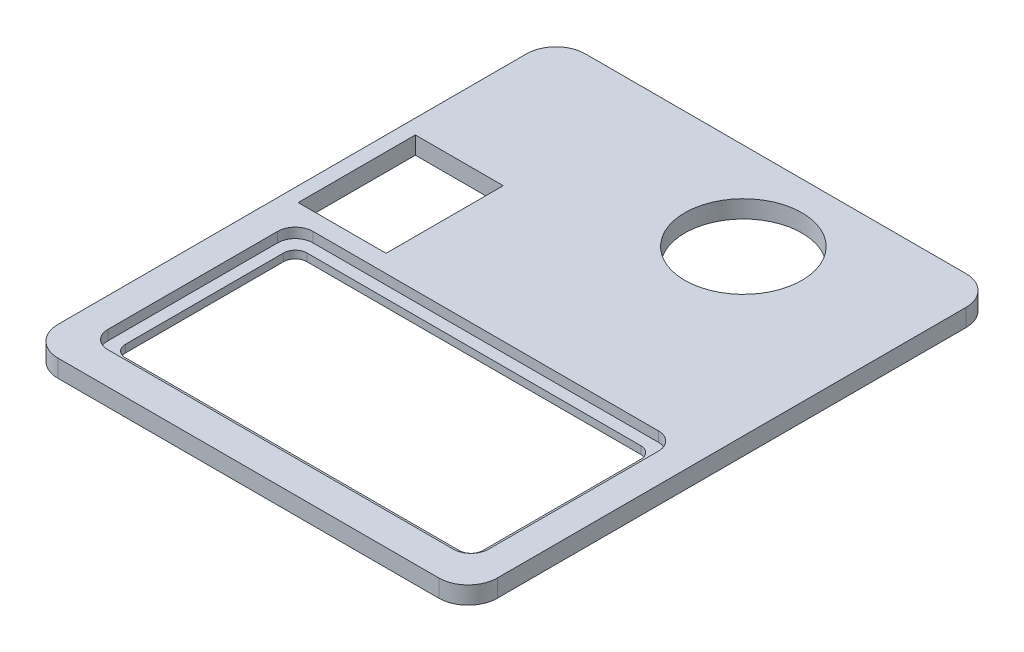
ISO-10303-21;
HEADER;
FILE_DESCRIPTION(('STEP AP214'),'2;1');
FILE_NAME('part.step','',(''),(''),'','','');
FILE_SCHEMA(('AUTOMOTIVE_DESIGN { 1 0 10303 214 1 1 1 1 }'));
ENDSEC;
DATA;
#1=APPLICATION_CONTEXT('core data for automotive mechanical design processes');
#2=APPLICATION_PROTOCOL_DEFINITION('international standard','automotive_design',2000,#1);
#3=PRODUCT_CONTEXT('',#1,'mechanical');
#4=PRODUCT('Part','Part','',(#3));
#5=PRODUCT_RELATED_PRODUCT_CATEGORY('part','',(#4));
#6=PRODUCT_DEFINITION_FORMATION('','',#4);
#7=PRODUCT_DEFINITION_CONTEXT('part definition',#1,'design');
#8=PRODUCT_DEFINITION('design','',#6,#7);
#9=PRODUCT_DEFINITION_SHAPE('','',#8);
#10=(LENGTH_UNIT() NAMED_UNIT(*) SI_UNIT(.MILLI.,.METRE.));
#11=(NAMED_UNIT(*) PLANE_ANGLE_UNIT() SI_UNIT($,.RADIAN.));
#12=(NAMED_UNIT(*) SI_UNIT($,.STERADIAN.) SOLID_ANGLE_UNIT());
#13=UNCERTAINTY_MEASURE_WITH_UNIT(LENGTH_MEASURE(1.E-05),#10,'distance_accuracy_value','');
#14=(GEOMETRIC_REPRESENTATION_CONTEXT(3) GLOBAL_UNCERTAINTY_ASSIGNED_CONTEXT((#13)) GLOBAL_UNIT_ASSIGNED_CONTEXT((#10,
#11,#12)) REPRESENTATION_CONTEXT('',''));
#15=CARTESIAN_POINT('',(0.,0.,0.));
#16=DIRECTION('',(0.,0.,1.));
#17=DIRECTION('',(1.,0.,0.));
#18=AXIS2_PLACEMENT_3D('',#15,#16,#17);
#19=CARTESIAN_POINT('',(70.,3.,-5.));
#20=DIRECTION('',(0.,1.,0.));
#21=DIRECTION('',(0.,0.,1.));
#22=AXIS2_PLACEMENT_3D('',#19,#20,#21);
#23=PLANE('',#22);
#24=CARTESIAN_POINT('',(8.,3.,-8.5));
#25=DIRECTION('',(0.,1.,0.));
#26=DIRECTION('',(0.,0.,1.));
#27=AXIS2_PLACEMENT_3D('',#24,#25,#26);
#28=CIRCLE('',#27,3.);
#29=CARTESIAN_POINT('',(5.,3.,-8.5));
#30=VERTEX_POINT('',#29);
#31=CARTESIAN_POINT('',(8.,3.,-5.5));
#32=VERTEX_POINT('',#31);
#33=EDGE_CURVE('E429',#30,#32,#28,.T.);
#34=ORIENTED_EDGE('',*,*,#33,.F.);
#35=DIRECTION('',(0.,0.,1.));
#36=VECTOR('',#35,1.);
#37=CARTESIAN_POINT('',(5.,3.,-5.));
#38=LINE('',#37,#36);
#39=CARTESIAN_POINT('',(5.,3.,-37.5));
#40=VERTEX_POINT('',#39);
#41=EDGE_CURVE('E405',#40,#30,#38,.T.);
#42=ORIENTED_EDGE('',*,*,#41,.F.);
#43=CARTESIAN_POINT('',(8.,3.,-37.5));
#44=DIRECTION('',(0.,1.,0.));
#45=DIRECTION('',(0.,0.,1.));
#46=AXIS2_PLACEMENT_3D('',#43,#44,#45);
#47=CIRCLE('',#46,3.);
#48=CARTESIAN_POINT('',(8.,3.,-40.5));
#49=VERTEX_POINT('',#48);
#50=EDGE_CURVE('E408',#49,#40,#47,.T.);
#51=ORIENTED_EDGE('',*,*,#50,.F.);
#52=DIRECTION('',(-1.,0.,0.));
#53=VECTOR('',#52,1.);
#54=CARTESIAN_POINT('',(70.,3.,-40.5));
#55=LINE('',#54,#53);
#56=CARTESIAN_POINT('',(67.,3.,-40.5));
#57=VERTEX_POINT('',#56);
#58=EDGE_CURVE('E411',#57,#49,#55,.T.);
#59=ORIENTED_EDGE('',*,*,#58,.F.);
#60=CARTESIAN_POINT('',(67.,3.,-37.5));
#61=DIRECTION('',(0.,1.,0.));
#62=DIRECTION('',(0.,0.,1.));
#63=AXIS2_PLACEMENT_3D('',#60,#61,#62);
#64=CIRCLE('',#63,3.00000000000001);
#65=CARTESIAN_POINT('',(70.,3.,-37.5));
#66=VERTEX_POINT('',#65);
#67=EDGE_CURVE('E414',#66,#57,#64,.T.);
#68=ORIENTED_EDGE('',*,*,#67,.F.);
#69=DIRECTION('',(0.,0.,1.));
#70=VECTOR('',#69,1.);
#71=CARTESIAN_POINT('',(70.,3.,-5.));
#72=LINE('',#71,#70);
#73=CARTESIAN_POINT('',(70.,3.,-8.49999999999999));
#74=VERTEX_POINT('',#73);
#75=EDGE_CURVE('E417',#66,#74,#72,.T.);
#76=ORIENTED_EDGE('',*,*,#75,.T.);
#77=CARTESIAN_POINT('',(67.,3.,-8.49999999999999));
#78=DIRECTION('',(0.,1.,0.));
#79=DIRECTION('',(0.,0.,1.));
#80=AXIS2_PLACEMENT_3D('',#77,#78,#79);
#81=CIRCLE('',#80,3.);
#82=CARTESIAN_POINT('',(67.,3.,-5.49999999999999));
#83=VERTEX_POINT('',#82);
#84=EDGE_CURVE('E421',#74,#83,#81,.F.);
#85=ORIENTED_EDGE('',*,*,#84,.T.);
#86=DIRECTION('',(-1.,0.,0.));
#87=VECTOR('',#86,1.);
#88=CARTESIAN_POINT('',(70.,3.,-5.49999999999999));
#89=LINE('',#88,#87);
#90=EDGE_CURVE('E425',#83,#32,#89,.T.);
#91=ORIENTED_EDGE('',*,*,#90,.T.);
#92=EDGE_LOOP('',(#34,#42,#51,#59,#68,#76,#85,#91));
#93=FACE_BOUND('',#92,.T.);
#94=CARTESIAN_POINT('',(70.,3.,-5.));
#95=DIRECTION('',(0.,1.,0.));
#96=DIRECTION('',(0.,0.,1.));
#97=AXIS2_PLACEMENT_3D('',#94,#95,#96);
#98=CIRCLE('',#97,5.);
#99=CARTESIAN_POINT('',(70.,3.,0.));
#100=VERTEX_POINT('',#99);
#101=CARTESIAN_POINT('',(75.,3.,-5.));
#102=VERTEX_POINT('',#101);
#103=EDGE_CURVE('E433',#100,#102,#98,.T.);
#104=ORIENTED_EDGE('',*,*,#103,.T.);
#105=DIRECTION('',(0.,0.,-1.));
#106=VECTOR('',#105,1.);
#107=CARTESIAN_POINT('',(75.,3.,-5.));
#108=LINE('',#107,#106);
#109=CARTESIAN_POINT('',(75.,3.,-85.));
#110=VERTEX_POINT('',#109);
#111=EDGE_CURVE('E437',#102,#110,#108,.T.);
#112=ORIENTED_EDGE('',*,*,#111,.T.);
#113=CARTESIAN_POINT('',(70.,3.,-85.));
#114=DIRECTION('',(0.,1.,0.));
#115=DIRECTION('',(0.,0.,-1.));
#116=AXIS2_PLACEMENT_3D('',#113,#114,#115);
#117=CIRCLE('',#116,5.);
#118=CARTESIAN_POINT('',(70.,3.,-90.));
#119=VERTEX_POINT('',#118);
#120=EDGE_CURVE('E441',#110,#119,#117,.T.);
#121=ORIENTED_EDGE('',*,*,#120,.T.);
#122=DIRECTION('',(-1.,0.,0.));
#123=VECTOR('',#122,1.);
#124=CARTESIAN_POINT('',(5.00000000000004,3.,-90.));
#125=LINE('',#124,#123);
#126=CARTESIAN_POINT('',(5.,3.,-90.));
#127=VERTEX_POINT('',#126);
#128=EDGE_CURVE('E444',#119,#127,#125,.T.);
#129=ORIENTED_EDGE('',*,*,#128,.T.);
#130=CARTESIAN_POINT('',(5.,3.,-85.));
#131=DIRECTION('',(0.,1.,0.));
#132=DIRECTION('',(0.,0.,-1.));
#133=AXIS2_PLACEMENT_3D('',#130,#131,#132);
#134=CIRCLE('',#133,5.);
#135=CARTESIAN_POINT('',(0.,3.,-85.));
#136=VERTEX_POINT('',#135);
#137=EDGE_CURVE('E447',#127,#136,#134,.T.);
#138=ORIENTED_EDGE('',*,*,#137,.T.);
#139=DIRECTION('',(0.,0.,1.));
#140=VECTOR('',#139,1.);
#141=CARTESIAN_POINT('',(0.,3.,-5.00000000000003));
#142=LINE('',#141,#140);
#143=CARTESIAN_POINT('',(0.,3.,-5.00000000000003));
#144=VERTEX_POINT('',#143);
#145=EDGE_CURVE('E450',#136,#144,#142,.T.);
#146=ORIENTED_EDGE('',*,*,#145,.T.);
#147=CARTESIAN_POINT('',(5.,3.,-5.));
#148=DIRECTION('',(0.,1.,0.));
#149=DIRECTION('',(0.,0.,-1.));
#150=AXIS2_PLACEMENT_3D('',#147,#148,#149);
#151=CIRCLE('',#150,5.);
#152=CARTESIAN_POINT('',(5.00000000000004,3.,0.));
#153=VERTEX_POINT('',#152);
#154=EDGE_CURVE('E453',#144,#153,#151,.T.);
#155=ORIENTED_EDGE('',*,*,#154,.T.);
#156=DIRECTION('',(1.,0.,0.));
#157=VECTOR('',#156,1.);
#158=CARTESIAN_POINT('',(5.00000000000004,3.,0.));
#159=LINE('',#158,#157);
#160=EDGE_CURVE('E456',#153,#100,#159,.T.);
#161=ORIENTED_EDGE('',*,*,#160,.T.);
#162=EDGE_LOOP('',(#104,#112,#121,#129,#138,#146,#155,#161));
#163=FACE_BOUND('',#162,.T.);
#164=DIRECTION('',(-1.,0.,0.));
#165=VECTOR('',#164,1.);
#166=CARTESIAN_POINT('',(70.,3.,-63.5));
#167=LINE('',#166,#165);
#168=CARTESIAN_POINT('',(17.5,3.,-63.5));
#169=VERTEX_POINT('',#168);
#170=CARTESIAN_POINT('',(2.5,3.,-63.5));
#171=VERTEX_POINT('',#170);
#172=EDGE_CURVE('E397',#169,#171,#167,.T.);
#173=ORIENTED_EDGE('',*,*,#172,.F.);
#174=DIRECTION('',(0.,0.,1.));
#175=VECTOR('',#174,1.);
#176=CARTESIAN_POINT('',(17.5,3.,-5.));
#177=LINE('',#176,#175);
#178=CARTESIAN_POINT('',(17.5,3.,-43.5));
#179=VERTEX_POINT('',#178);
#180=EDGE_CURVE('E346',#169,#179,#177,.T.);
#181=ORIENTED_EDGE('',*,*,#180,.T.);
#182=DIRECTION('',(-1.,0.,0.));
#183=VECTOR('',#182,1.);
#184=CARTESIAN_POINT('',(70.,3.,-43.5));
#185=LINE('',#184,#183);
#186=CARTESIAN_POINT('',(2.5,3.,-43.5));
#187=VERTEX_POINT('',#186);
#188=EDGE_CURVE('E390',#179,#187,#185,.T.);
#189=ORIENTED_EDGE('',*,*,#188,.T.);
#190=DIRECTION('',(0.,0.,1.));
#191=VECTOR('',#190,1.);
#192=CARTESIAN_POINT('',(2.5,3.,-5.));
#193=LINE('',#192,#191);
#194=EDGE_CURVE('E394',#171,#187,#193,.T.);
#195=ORIENTED_EDGE('',*,*,#194,.F.);
#196=EDGE_LOOP('',(#173,#181,#189,#195));
#197=FACE_BOUND('',#196,.T.);
#198=CARTESIAN_POINT('',(47.,3.,-75.));
#199=DIRECTION('',(0.,1.,0.));
#200=DIRECTION('',(0.,0.,1.));
#201=AXIS2_PLACEMENT_3D('',#198,#199,#200);
#202=CIRCLE('',#201,9.99999999999999);
#203=CARTESIAN_POINT('',(47.,3.,-65.));
#204=VERTEX_POINT('',#203);
#205=EDGE_CURVE('E401',#204,#204,#202,.F.);
#206=ORIENTED_EDGE('',*,*,#205,.T.);
#207=EDGE_LOOP('',(#206));
#208=FACE_BOUND('',#207,.T.);
#209=ADVANCED_FACE('F39',(#93,#163,#197,#208),#23,.T.);
#210=CARTESIAN_POINT('',(70.,0.,-5.));
#211=DIRECTION('',(0.,1.,0.));
#212=DIRECTION('',(0.,0.,1.));
#213=AXIS2_PLACEMENT_3D('',#210,#211,#212);
#214=PLANE('',#213);
#215=DIRECTION('',(0.,0.,1.));
#216=VECTOR('',#215,1.);
#217=CARTESIAN_POINT('',(17.5,0.,-5.));
#218=LINE('',#217,#216);
#219=CARTESIAN_POINT('',(17.5,0.,-63.5));
#220=VERTEX_POINT('',#219);
#221=CARTESIAN_POINT('',(17.5,0.,-43.5));
#222=VERTEX_POINT('',#221);
#223=EDGE_CURVE('E514',#220,#222,#218,.T.);
#224=ORIENTED_EDGE('',*,*,#223,.F.);
#225=DIRECTION('',(-1.,0.,0.));
#226=VECTOR('',#225,1.);
#227=CARTESIAN_POINT('',(70.,0.,-63.5));
#228=LINE('',#227,#226);
#229=CARTESIAN_POINT('',(2.5,0.,-63.5));
#230=VERTEX_POINT('',#229);
#231=EDGE_CURVE('E48',#220,#230,#228,.T.);
#232=ORIENTED_EDGE('',*,*,#231,.T.);
#233=DIRECTION('',(0.,0.,1.));
#234=VECTOR('',#233,1.);
#235=CARTESIAN_POINT('',(2.5,0.,-5.));
#236=LINE('',#235,#234);
#237=CARTESIAN_POINT('',(2.5,0.,-43.5));
#238=VERTEX_POINT('',#237);
#239=EDGE_CURVE('E520',#230,#238,#236,.T.);
#240=ORIENTED_EDGE('',*,*,#239,.T.);
#241=DIRECTION('',(-1.,0.,0.));
#242=VECTOR('',#241,1.);
#243=CARTESIAN_POINT('',(70.,0.,-43.5));
#244=LINE('',#243,#242);
#245=EDGE_CURVE('E517',#222,#238,#244,.T.);
#246=ORIENTED_EDGE('',*,*,#245,.F.);
#247=EDGE_LOOP('',(#224,#232,#240,#246));
#248=FACE_BOUND('',#247,.T.);
#249=CARTESIAN_POINT('',(70.,0.,-5.));
#250=DIRECTION('',(0.,1.,0.));
#251=DIRECTION('',(0.,0.,1.));
#252=AXIS2_PLACEMENT_3D('',#249,#250,#251);
#253=CIRCLE('',#252,5.);
#254=CARTESIAN_POINT('',(70.,0.,0.));
#255=VERTEX_POINT('',#254);
#256=CARTESIAN_POINT('',(75.,0.,-5.));
#257=VERTEX_POINT('',#256);
#258=EDGE_CURVE('E432',#255,#257,#253,.T.);
#259=ORIENTED_EDGE('',*,*,#258,.F.);
#260=DIRECTION('',(1.,0.,0.));
#261=VECTOR('',#260,1.);
#262=CARTESIAN_POINT('',(5.00000000000004,0.,0.));
#263=LINE('',#262,#261);
#264=CARTESIAN_POINT('',(5.00000000000004,0.,0.));
#265=VERTEX_POINT('',#264);
#266=EDGE_CURVE('E438',#265,#255,#263,.T.);
#267=ORIENTED_EDGE('',*,*,#266,.F.);
#268=CARTESIAN_POINT('',(5.,0.,-5.));
#269=DIRECTION('',(0.,1.,0.));
#270=DIRECTION('',(0.,0.,-1.));
#271=AXIS2_PLACEMENT_3D('',#268,#269,#270);
#272=CIRCLE('',#271,5.);
#273=CARTESIAN_POINT('',(0.,0.,-5.00000000000003));
#274=VERTEX_POINT('',#273);
#275=EDGE_CURVE('E478',#274,#265,#272,.T.);
#276=ORIENTED_EDGE('',*,*,#275,.F.);
#277=DIRECTION('',(0.,0.,1.));
#278=VECTOR('',#277,1.);
#279=CARTESIAN_POINT('',(0.,0.,-5.00000000000003));
#280=LINE('',#279,#278);
#281=CARTESIAN_POINT('',(0.,0.,-85.));
#282=VERTEX_POINT('',#281);
#283=EDGE_CURVE('E475',#282,#274,#280,.T.);
#284=ORIENTED_EDGE('',*,*,#283,.F.);
#285=CARTESIAN_POINT('',(5.,0.,-85.));
#286=DIRECTION('',(0.,1.,0.));
#287=DIRECTION('',(0.,0.,-1.));
#288=AXIS2_PLACEMENT_3D('',#285,#286,#287);
#289=CIRCLE('',#288,5.);
#290=CARTESIAN_POINT('',(5.,0.,-90.));
#291=VERTEX_POINT('',#290);
#292=EDGE_CURVE('E472',#291,#282,#289,.T.);
#293=ORIENTED_EDGE('',*,*,#292,.F.);
#294=DIRECTION('',(-1.,0.,0.));
#295=VECTOR('',#294,1.);
#296=CARTESIAN_POINT('',(5.00000000000004,0.,-90.));
#297=LINE('',#296,#295);
#298=CARTESIAN_POINT('',(70.,0.,-90.));
#299=VERTEX_POINT('',#298);
#300=EDGE_CURVE('E469',#299,#291,#297,.T.);
#301=ORIENTED_EDGE('',*,*,#300,.F.);
#302=CARTESIAN_POINT('',(70.,0.,-85.));
#303=DIRECTION('',(0.,1.,0.));
#304=DIRECTION('',(0.,0.,-1.));
#305=AXIS2_PLACEMENT_3D('',#302,#303,#304);
#306=CIRCLE('',#305,5.);
#307=CARTESIAN_POINT('',(75.,0.,-85.));
#308=VERTEX_POINT('',#307);
#309=EDGE_CURVE('E466',#308,#299,#306,.T.);
#310=ORIENTED_EDGE('',*,*,#309,.F.);
#311=DIRECTION('',(0.,0.,-1.));
#312=VECTOR('',#311,1.);
#313=CARTESIAN_POINT('',(75.,0.,-5.));
#314=LINE('',#313,#312);
#315=EDGE_CURVE('E463',#257,#308,#314,.T.);
#316=ORIENTED_EDGE('',*,*,#315,.F.);
#317=EDGE_LOOP('',(#259,#267,#276,#284,#293,#301,#310,#316));
#318=FACE_BOUND('',#317,.T.);
#319=CARTESIAN_POINT('',(47.,0.,-75.));
#320=DIRECTION('',(0.,1.,0.));
#321=DIRECTION('',(0.,0.,1.));
#322=AXIS2_PLACEMENT_3D('',#319,#320,#321);
#323=CIRCLE('',#322,9.99999999999999);
#324=CARTESIAN_POINT('',(47.,0.,-65.));
#325=VERTEX_POINT('',#324);
#326=EDGE_CURVE('E400',#325,#325,#323,.F.);
#327=ORIENTED_EDGE('',*,*,#326,.F.);
#328=EDGE_LOOP('',(#327));
#329=FACE_BOUND('',#328,.T.);
#330=CARTESIAN_POINT('',(9.00000000000001,0.,-9.49999999999999));
#331=DIRECTION('',(0.,1.,0.));
#332=DIRECTION('',(0.,0.,1.));
#333=AXIS2_PLACEMENT_3D('',#330,#331,#332);
#334=CIRCLE('',#333,2.);
#335=CARTESIAN_POINT('',(7.00000000000001,0.,-9.49999999999999));
#336=VERTEX_POINT('',#335);
#337=CARTESIAN_POINT('',(9.00000000000001,0.,-7.49999999999999));
#338=VERTEX_POINT('',#337);
#339=EDGE_CURVE('E273',#336,#338,#334,.T.);
#340=ORIENTED_EDGE('',*,*,#339,.T.);
#341=DIRECTION('',(1.,0.,0.));
#342=VECTOR('',#341,1.);
#343=CARTESIAN_POINT('',(9.00000000000001,0.,-7.49999999999999));
#344=LINE('',#343,#342);
#345=CARTESIAN_POINT('',(66.,0.,-7.49999999999999));
#346=VERTEX_POINT('',#345);
#347=EDGE_CURVE('E243',#338,#346,#344,.T.);
#348=ORIENTED_EDGE('',*,*,#347,.T.);
#349=CARTESIAN_POINT('',(66.,0.,-9.49999999999999));
#350=DIRECTION('',(0.,1.,0.));
#351=DIRECTION('',(0.,0.,1.));
#352=AXIS2_PLACEMENT_3D('',#349,#350,#351);
#353=CIRCLE('',#352,2.);
#354=CARTESIAN_POINT('',(68.,0.,-9.49999999999999));
#355=VERTEX_POINT('',#354);
#356=EDGE_CURVE('E278',#346,#355,#353,.T.);
#357=ORIENTED_EDGE('',*,*,#356,.T.);
#358=DIRECTION('',(0.,0.,-1.));
#359=VECTOR('',#358,1.);
#360=CARTESIAN_POINT('',(68.,0.,-36.5));
#361=LINE('',#360,#359);
#362=CARTESIAN_POINT('',(68.,0.,-36.5));
#363=VERTEX_POINT('',#362);
#364=EDGE_CURVE('E282',#355,#363,#361,.T.);
#365=ORIENTED_EDGE('',*,*,#364,.T.);
#366=CARTESIAN_POINT('',(66.,0.,-36.5));
#367=DIRECTION('',(0.,1.,0.));
#368=DIRECTION('',(0.,0.,-1.));
#369=AXIS2_PLACEMENT_3D('',#366,#367,#368);
#370=CIRCLE('',#369,2.);
#371=CARTESIAN_POINT('',(66.,0.,-38.5));
#372=VERTEX_POINT('',#371);
#373=EDGE_CURVE('E286',#363,#372,#370,.T.);
#374=ORIENTED_EDGE('',*,*,#373,.T.);
#375=DIRECTION('',(-1.,0.,0.));
#376=VECTOR('',#375,1.);
#377=CARTESIAN_POINT('',(9.00000000000001,0.,-38.5));
#378=LINE('',#377,#376);
#379=CARTESIAN_POINT('',(9.00000000000001,0.,-38.5));
#380=VERTEX_POINT('',#379);
#381=EDGE_CURVE('E290',#372,#380,#378,.T.);
#382=ORIENTED_EDGE('',*,*,#381,.T.);
#383=CARTESIAN_POINT('',(9.00000000000001,0.,-36.5));
#384=DIRECTION('',(0.,1.,0.));
#385=DIRECTION('',(0.,0.,1.));
#386=AXIS2_PLACEMENT_3D('',#383,#384,#385);
#387=CIRCLE('',#386,2.);
#388=CARTESIAN_POINT('',(7.00000000000001,0.,-36.5));
#389=VERTEX_POINT('',#388);
#390=EDGE_CURVE('E294',#380,#389,#387,.T.);
#391=ORIENTED_EDGE('',*,*,#390,.T.);
#392=DIRECTION('',(0.,0.,1.));
#393=VECTOR('',#392,1.);
#394=CARTESIAN_POINT('',(7.00000000000001,0.,-36.5));
#395=LINE('',#394,#393);
#396=EDGE_CURVE('E237',#389,#336,#395,.T.);
#397=ORIENTED_EDGE('',*,*,#396,.T.);
#398=EDGE_LOOP('',(#340,#348,#357,#365,#374,#382,#391,#397));
#399=FACE_BOUND('',#398,.T.);
#400=ADVANCED_FACE('F532',(#248,#318,#329,#399),#214,.F.);
#401=CARTESIAN_POINT('',(70.,3.,-5.));
#402=DIRECTION('',(0.,-1.,0.));
#403=DIRECTION('',(0.,0.,-1.));
#404=AXIS2_PLACEMENT_3D('',#401,#402,#403);
#405=CYLINDRICAL_SURFACE('',#404,5.);
#406=ORIENTED_EDGE('',*,*,#258,.T.);
#407=DIRECTION('',(0.,-1.,0.));
#408=VECTOR('',#407,1.);
#409=CARTESIAN_POINT('',(75.,3.,-5.));
#410=LINE('',#409,#408);
#411=EDGE_CURVE('E510',#102,#257,#410,.T.);
#412=ORIENTED_EDGE('',*,*,#411,.F.);
#413=ORIENTED_EDGE('',*,*,#103,.F.);
#414=DIRECTION('',(0.,-1.,0.));
#415=VECTOR('',#414,1.);
#416=CARTESIAN_POINT('',(70.,3.,0.));
#417=LINE('',#416,#415);
#418=EDGE_CURVE('E459',#100,#255,#417,.T.);
#419=ORIENTED_EDGE('',*,*,#418,.T.);
#420=EDGE_LOOP('',(#406,#412,#413,#419));
#421=FACE_BOUND('',#420,.T.);
#422=ADVANCED_FACE('F41',(#421),#405,.T.);
#423=CARTESIAN_POINT('',(75.,3.,-5.));
#424=DIRECTION('',(-1.,0.,0.));
#425=DIRECTION('',(0.,0.,1.));
#426=AXIS2_PLACEMENT_3D('',#423,#424,#425);
#427=PLANE('',#426);
#428=ORIENTED_EDGE('',*,*,#315,.T.);
#429=DIRECTION('',(0.,-1.,0.));
#430=VECTOR('',#429,1.);
#431=CARTESIAN_POINT('',(75.,3.,-85.));
#432=LINE('',#431,#430);
#433=EDGE_CURVE('E506',#110,#308,#432,.T.);
#434=ORIENTED_EDGE('',*,*,#433,.F.);
#435=ORIENTED_EDGE('',*,*,#111,.F.);
#436=ORIENTED_EDGE('',*,*,#411,.T.);
#437=EDGE_LOOP('',(#428,#434,#435,#436));
#438=FACE_BOUND('',#437,.T.);
#439=ADVANCED_FACE('F604',(#438),#427,.F.);
#440=CARTESIAN_POINT('',(70.,3.,-85.));
#441=DIRECTION('',(0.,-1.,0.));
#442=DIRECTION('',(0.,0.,-1.));
#443=AXIS2_PLACEMENT_3D('',#440,#441,#442);
#444=CYLINDRICAL_SURFACE('',#443,5.);
#445=ORIENTED_EDGE('',*,*,#309,.T.);
#446=DIRECTION('',(0.,-1.,0.));
#447=VECTOR('',#446,1.);
#448=CARTESIAN_POINT('',(70.,3.,-90.));
#449=LINE('',#448,#447);
#450=EDGE_CURVE('E502',#119,#299,#449,.T.);
#451=ORIENTED_EDGE('',*,*,#450,.F.);
#452=ORIENTED_EDGE('',*,*,#120,.F.);
#453=ORIENTED_EDGE('',*,*,#433,.T.);
#454=EDGE_LOOP('',(#445,#451,#452,#453));
#455=FACE_BOUND('',#454,.T.);
#456=ADVANCED_FACE('F601',(#455),#444,.T.);
#457=CARTESIAN_POINT('',(5.00000000000004,3.,-90.));
#458=DIRECTION('',(0.,0.,1.));
#459=DIRECTION('',(1.,0.,0.));
#460=AXIS2_PLACEMENT_3D('',#457,#458,#459);
#461=PLANE('',#460);
#462=ORIENTED_EDGE('',*,*,#300,.T.);
#463=DIRECTION('',(0.,-1.,0.));
#464=VECTOR('',#463,1.);
#465=CARTESIAN_POINT('',(5.,3.,-90.));
#466=LINE('',#465,#464);
#467=EDGE_CURVE('E498',#127,#291,#466,.T.);
#468=ORIENTED_EDGE('',*,*,#467,.F.);
#469=ORIENTED_EDGE('',*,*,#128,.F.);
#470=ORIENTED_EDGE('',*,*,#450,.T.);
#471=EDGE_LOOP('',(#462,#468,#469,#470));
#472=FACE_BOUND('',#471,.T.);
#473=ADVANCED_FACE('F597',(#472),#461,.F.);
#474=CARTESIAN_POINT('',(5.,3.,-85.));
#475=DIRECTION('',(0.,-1.,0.));
#476=DIRECTION('',(0.,0.,-1.));
#477=AXIS2_PLACEMENT_3D('',#474,#475,#476);
#478=CYLINDRICAL_SURFACE('',#477,5.);
#479=ORIENTED_EDGE('',*,*,#292,.T.);
#480=DIRECTION('',(0.,-1.,0.));
#481=VECTOR('',#480,1.);
#482=CARTESIAN_POINT('',(0.,3.,-85.));
#483=LINE('',#482,#481);
#484=EDGE_CURVE('E494',#136,#282,#483,.T.);
#485=ORIENTED_EDGE('',*,*,#484,.F.);
#486=ORIENTED_EDGE('',*,*,#137,.F.);
#487=ORIENTED_EDGE('',*,*,#467,.T.);
#488=EDGE_LOOP('',(#479,#485,#486,#487));
#489=FACE_BOUND('',#488,.T.);
#490=ADVANCED_FACE('F593',(#489),#478,.T.);
#491=CARTESIAN_POINT('',(0.,3.,-5.00000000000003));
#492=DIRECTION('',(1.,0.,0.));
#493=DIRECTION('',(0.,0.,-1.));
#494=AXIS2_PLACEMENT_3D('',#491,#492,#493);
#495=PLANE('',#494);
#496=ORIENTED_EDGE('',*,*,#283,.T.);
#497=DIRECTION('',(0.,-1.,0.));
#498=VECTOR('',#497,1.);
#499=CARTESIAN_POINT('',(0.,3.,-5.00000000000003));
#500=LINE('',#499,#498);
#501=EDGE_CURVE('E490',#144,#274,#500,.T.);
#502=ORIENTED_EDGE('',*,*,#501,.F.);
#503=ORIENTED_EDGE('',*,*,#145,.F.);
#504=ORIENTED_EDGE('',*,*,#484,.T.);
#505=EDGE_LOOP('',(#496,#502,#503,#504));
#506=FACE_BOUND('',#505,.T.);
#507=ADVANCED_FACE('F589',(#506),#495,.F.);
#508=CARTESIAN_POINT('',(5.,3.,-5.));
#509=DIRECTION('',(0.,-1.,0.));
#510=DIRECTION('',(0.,0.,-1.));
#511=AXIS2_PLACEMENT_3D('',#508,#509,#510);
#512=CYLINDRICAL_SURFACE('',#511,5.);
#513=ORIENTED_EDGE('',*,*,#275,.T.);
#514=DIRECTION('',(0.,-1.,0.));
#515=VECTOR('',#514,1.);
#516=CARTESIAN_POINT('',(5.00000000000004,3.,0.));
#517=LINE('',#516,#515);
#518=EDGE_CURVE('E486',#153,#265,#517,.T.);
#519=ORIENTED_EDGE('',*,*,#518,.F.);
#520=ORIENTED_EDGE('',*,*,#154,.F.);
#521=ORIENTED_EDGE('',*,*,#501,.T.);
#522=EDGE_LOOP('',(#513,#519,#520,#521));
#523=FACE_BOUND('',#522,.T.);
#524=ADVANCED_FACE('F585',(#523),#512,.T.);
#525=CARTESIAN_POINT('',(5.00000000000004,3.,0.));
#526=DIRECTION('',(0.,0.,-1.));
#527=DIRECTION('',(-1.,0.,0.));
#528=AXIS2_PLACEMENT_3D('',#525,#526,#527);
#529=PLANE('',#528);
#530=ORIENTED_EDGE('',*,*,#266,.T.);
#531=ORIENTED_EDGE('',*,*,#418,.F.);
#532=ORIENTED_EDGE('',*,*,#160,.F.);
#533=ORIENTED_EDGE('',*,*,#518,.T.);
#534=EDGE_LOOP('',(#530,#531,#532,#533));
#535=FACE_BOUND('',#534,.T.);
#536=ADVANCED_FACE('F581',(#535),#529,.F.);
#537=CARTESIAN_POINT('',(2.5,6.99999999999999,-63.5));
#538=DIRECTION('',(0.,0.,-1.));
#539=DIRECTION('',(-1.,0.,0.));
#540=AXIS2_PLACEMENT_3D('',#537,#538,#539);
#541=PLANE('',#540);
#542=ORIENTED_EDGE('',*,*,#172,.T.);
#543=DIRECTION('',(0.,-1.,0.));
#544=VECTOR('',#543,1.);
#545=CARTESIAN_POINT('',(2.5,6.99999999999999,-63.5));
#546=LINE('',#545,#544);
#547=EDGE_CURVE('E341',#171,#230,#546,.T.);
#548=ORIENTED_EDGE('',*,*,#547,.T.);
#549=ORIENTED_EDGE('',*,*,#231,.F.);
#550=DIRECTION('',(0.,-1.,0.));
#551=VECTOR('',#550,1.);
#552=CARTESIAN_POINT('',(17.5,6.99999999999999,-63.5));
#553=LINE('',#552,#551);
#554=EDGE_CURVE('E373',#169,#220,#553,.T.);
#555=ORIENTED_EDGE('',*,*,#554,.F.);
#556=EDGE_LOOP('',(#542,#548,#549,#555));
#557=FACE_BOUND('',#556,.T.);
#558=ADVANCED_FACE('F584',(#557),#541,.F.);
#559=CARTESIAN_POINT('',(2.5,6.99999999999999,-43.5));
#560=DIRECTION('',(-1.,0.,0.));
#561=DIRECTION('',(0.,0.,1.));
#562=AXIS2_PLACEMENT_3D('',#559,#560,#561);
#563=PLANE('',#562);
#564=ORIENTED_EDGE('',*,*,#194,.T.);
#565=DIRECTION('',(0.,-1.,0.));
#566=VECTOR('',#565,1.);
#567=CARTESIAN_POINT('',(2.5,6.99999999999999,-43.5));
#568=LINE('',#567,#566);
#569=EDGE_CURVE('E380',#187,#238,#568,.T.);
#570=ORIENTED_EDGE('',*,*,#569,.T.);
#571=ORIENTED_EDGE('',*,*,#239,.F.);
#572=ORIENTED_EDGE('',*,*,#547,.F.);
#573=EDGE_LOOP('',(#564,#570,#571,#572));
#574=FACE_BOUND('',#573,.T.);
#575=ADVANCED_FACE('F578',(#574),#563,.F.);
#576=CARTESIAN_POINT('',(2.5,6.99999999999999,-43.5));
#577=DIRECTION('',(0.,0.,-1.));
#578=DIRECTION('',(-1.,0.,0.));
#579=AXIS2_PLACEMENT_3D('',#576,#577,#578);
#580=PLANE('',#579);
#581=DIRECTION('',(0.,-1.,0.));
#582=VECTOR('',#581,1.);
#583=CARTESIAN_POINT('',(17.5,6.99999999999999,-43.5));
#584=LINE('',#583,#582);
#585=EDGE_CURVE('E376',#179,#222,#584,.T.);
#586=ORIENTED_EDGE('',*,*,#585,.T.);
#587=ORIENTED_EDGE('',*,*,#245,.T.);
#588=ORIENTED_EDGE('',*,*,#569,.F.);
#589=ORIENTED_EDGE('',*,*,#188,.F.);
#590=EDGE_LOOP('',(#586,#587,#588,#589));
#591=FACE_BOUND('',#590,.T.);
#592=ADVANCED_FACE('F652',(#591),#580,.T.);
#593=CARTESIAN_POINT('',(17.5,6.99999999999999,-43.5));
#594=DIRECTION('',(-1.,0.,0.));
#595=DIRECTION('',(0.,0.,1.));
#596=AXIS2_PLACEMENT_3D('',#593,#594,#595);
#597=PLANE('',#596);
#598=ORIENTED_EDGE('',*,*,#554,.T.);
#599=ORIENTED_EDGE('',*,*,#223,.T.);
#600=ORIENTED_EDGE('',*,*,#585,.F.);
#601=ORIENTED_EDGE('',*,*,#180,.F.);
#602=EDGE_LOOP('',(#598,#599,#600,#601));
#603=FACE_BOUND('',#602,.T.);
#604=ADVANCED_FACE('F643',(#603),#597,.T.);
#605=CARTESIAN_POINT('',(47.,6.99999999999999,-75.));
#606=DIRECTION('',(0.,-1.,0.));
#607=DIRECTION('',(0.,0.,-1.));
#608=AXIS2_PLACEMENT_3D('',#605,#606,#607);
#609=CYLINDRICAL_SURFACE('',#608,9.99999999999999);
#610=ORIENTED_EDGE('',*,*,#205,.F.);
#611=EDGE_LOOP('',(#610));
#612=FACE_BOUND('',#611,.T.);
#613=ORIENTED_EDGE('',*,*,#326,.T.);
#614=EDGE_LOOP('',(#613));
#615=FACE_BOUND('',#614,.T.);
#616=ADVANCED_FACE('F530',(#612,#615),#609,.F.);
#617=CARTESIAN_POINT('',(8.,6.99999999999999,-8.5));
#618=DIRECTION('',(0.,-1.,0.));
#619=DIRECTION('',(0.,0.,-1.));
#620=AXIS2_PLACEMENT_3D('',#617,#618,#619);
#621=CYLINDRICAL_SURFACE('',#620,3.);
#622=DIRECTION('',(0.,-1.,0.));
#623=VECTOR('',#622,1.);
#624=CARTESIAN_POINT('',(8.,6.99999999999999,-5.5));
#625=LINE('',#624,#623);
#626=CARTESIAN_POINT('',(8.,1.3,-5.49999999999999));
#627=VERTEX_POINT('',#626);
#628=EDGE_CURVE('E342',#32,#627,#625,.T.);
#629=ORIENTED_EDGE('',*,*,#628,.T.);
#630=CARTESIAN_POINT('',(8.,1.3,-8.5));
#631=DIRECTION('',(0.,1.,0.));
#632=DIRECTION('',(0.,0.,1.));
#633=AXIS2_PLACEMENT_3D('',#630,#631,#632);
#634=CIRCLE('',#633,3.);
#635=CARTESIAN_POINT('',(5.00000000000001,1.3,-8.5));
#636=VERTEX_POINT('',#635);
#637=EDGE_CURVE('E337',#627,#636,#634,.F.);
#638=ORIENTED_EDGE('',*,*,#637,.T.);
#639=DIRECTION('',(0.,-1.,0.));
#640=VECTOR('',#639,1.);
#641=CARTESIAN_POINT('',(5.,6.99999999999999,-8.5));
#642=LINE('',#641,#640);
#643=EDGE_CURVE('E369',#30,#636,#642,.T.);
#644=ORIENTED_EDGE('',*,*,#643,.F.);
#645=ORIENTED_EDGE('',*,*,#33,.T.);
#646=EDGE_LOOP('',(#629,#638,#644,#645));
#647=FACE_BOUND('',#646,.T.);
#648=ADVANCED_FACE('F642',(#647),#621,.F.);
#649=CARTESIAN_POINT('',(8.,6.99999999999999,-5.5));
#650=DIRECTION('',(0.,0.,-1.));
#651=DIRECTION('',(-1.,0.,0.));
#652=AXIS2_PLACEMENT_3D('',#649,#650,#651);
#653=PLANE('',#652);
#654=DIRECTION('',(1.,0.,0.));
#655=VECTOR('',#654,1.);
#656=CARTESIAN_POINT('',(5.00000000000001,1.3,-5.49999999999999));
#657=LINE('',#656,#655);
#658=CARTESIAN_POINT('',(67.,1.3,-5.49999999999999));
#659=VERTEX_POINT('',#658);
#660=EDGE_CURVE('E245',#627,#659,#657,.T.);
#661=ORIENTED_EDGE('',*,*,#660,.F.);
#662=ORIENTED_EDGE('',*,*,#628,.F.);
#663=ORIENTED_EDGE('',*,*,#90,.F.);
#664=DIRECTION('',(0.,-1.,0.));
#665=VECTOR('',#664,1.);
#666=CARTESIAN_POINT('',(67.,6.99999999999999,-5.49999999999999));
#667=LINE('',#666,#665);
#668=EDGE_CURVE('E347',#83,#659,#667,.T.);
#669=ORIENTED_EDGE('',*,*,#668,.T.);
#670=EDGE_LOOP('',(#661,#662,#663,#669));
#671=FACE_BOUND('',#670,.T.);
#672=ADVANCED_FACE('F649',(#671),#653,.T.);
#673=CARTESIAN_POINT('',(67.,6.99999999999999,-8.49999999999999));
#674=DIRECTION('',(0.,-1.,0.));
#675=DIRECTION('',(0.,0.,-1.));
#676=AXIS2_PLACEMENT_3D('',#673,#674,#675);
#677=CYLINDRICAL_SURFACE('',#676,3.);
#678=CARTESIAN_POINT('',(67.,1.3,-8.49999999999999));
#679=DIRECTION('',(0.,1.,0.));
#680=DIRECTION('',(0.,0.,1.));
#681=AXIS2_PLACEMENT_3D('',#678,#679,#680);
#682=CIRCLE('',#681,3.);
#683=CARTESIAN_POINT('',(70.,1.3,-8.49999999999999));
#684=VERTEX_POINT('',#683);
#685=EDGE_CURVE('E334',#659,#684,#682,.T.);
#686=ORIENTED_EDGE('',*,*,#685,.F.);
#687=ORIENTED_EDGE('',*,*,#668,.F.);
#688=ORIENTED_EDGE('',*,*,#84,.F.);
#689=DIRECTION('',(0.,-1.,0.));
#690=VECTOR('',#689,1.);
#691=CARTESIAN_POINT('',(70.,6.99999999999999,-8.49999999999999));
#692=LINE('',#691,#690);
#693=EDGE_CURVE('E351',#74,#684,#692,.T.);
#694=ORIENTED_EDGE('',*,*,#693,.T.);
#695=EDGE_LOOP('',(#686,#687,#688,#694));
#696=FACE_BOUND('',#695,.T.);
#697=ADVANCED_FACE('F739',(#696),#677,.F.);
#698=CARTESIAN_POINT('',(70.,6.99999999999999,-8.49999999999999));
#699=DIRECTION('',(-1.,0.,0.));
#700=DIRECTION('',(0.,0.,1.));
#701=AXIS2_PLACEMENT_3D('',#698,#699,#700);
#702=PLANE('',#701);
#703=DIRECTION('',(0.,0.,-1.));
#704=VECTOR('',#703,1.);
#705=CARTESIAN_POINT('',(70.,1.3,-40.5));
#706=LINE('',#705,#704);
#707=CARTESIAN_POINT('',(70.,1.3,-37.5));
#708=VERTEX_POINT('',#707);
#709=EDGE_CURVE('E322',#684,#708,#706,.T.);
#710=ORIENTED_EDGE('',*,*,#709,.F.);
#711=ORIENTED_EDGE('',*,*,#693,.F.);
#712=ORIENTED_EDGE('',*,*,#75,.F.);
#713=DIRECTION('',(0.,-1.,0.));
#714=VECTOR('',#713,1.);
#715=CARTESIAN_POINT('',(70.,6.99999999999999,-37.5));
#716=LINE('',#715,#714);
#717=EDGE_CURVE('E355',#66,#708,#716,.T.);
#718=ORIENTED_EDGE('',*,*,#717,.T.);
#719=EDGE_LOOP('',(#710,#711,#712,#718));
#720=FACE_BOUND('',#719,.T.);
#721=ADVANCED_FACE('F749',(#720),#702,.T.);
#722=CARTESIAN_POINT('',(67.,6.99999999999999,-37.5));
#723=DIRECTION('',(0.,-1.,0.));
#724=DIRECTION('',(0.,0.,-1.));
#725=AXIS2_PLACEMENT_3D('',#722,#723,#724);
#726=CYLINDRICAL_SURFACE('',#725,3.00000000000001);
#727=DIRECTION('',(0.,-1.,0.));
#728=VECTOR('',#727,1.);
#729=CARTESIAN_POINT('',(67.,6.99999999999999,-40.5));
#730=LINE('',#729,#728);
#731=CARTESIAN_POINT('',(67.,1.3,-40.5));
#732=VERTEX_POINT('',#731);
#733=EDGE_CURVE('E359',#57,#732,#730,.T.);
#734=ORIENTED_EDGE('',*,*,#733,.T.);
#735=CARTESIAN_POINT('',(67.,1.3,-37.5));
#736=DIRECTION('',(0.,1.,0.));
#737=DIRECTION('',(0.,0.,1.));
#738=AXIS2_PLACEMENT_3D('',#735,#736,#737);
#739=CIRCLE('',#738,3.00000000000001);
#740=EDGE_CURVE('E330',#732,#708,#739,.F.);
#741=ORIENTED_EDGE('',*,*,#740,.T.);
#742=ORIENTED_EDGE('',*,*,#717,.F.);
#743=ORIENTED_EDGE('',*,*,#67,.T.);
#744=EDGE_LOOP('',(#734,#741,#742,#743));
#745=FACE_BOUND('',#744,.T.);
#746=ADVANCED_FACE('F759',(#745),#726,.F.);
#747=CARTESIAN_POINT('',(8.,6.99999999999999,-40.5));
#748=DIRECTION('',(0.,0.,-1.));
#749=DIRECTION('',(-1.,0.,0.));
#750=AXIS2_PLACEMENT_3D('',#747,#748,#749);
#751=PLANE('',#750);
#752=DIRECTION('',(0.,-1.,0.));
#753=VECTOR('',#752,1.);
#754=CARTESIAN_POINT('',(8.,6.99999999999999,-40.5));
#755=LINE('',#754,#753);
#756=CARTESIAN_POINT('',(8.,1.3,-40.5));
#757=VERTEX_POINT('',#756);
#758=EDGE_CURVE('E363',#49,#757,#755,.T.);
#759=ORIENTED_EDGE('',*,*,#758,.T.);
#760=DIRECTION('',(-1.,0.,0.));
#761=VECTOR('',#760,1.);
#762=CARTESIAN_POINT('',(5.,1.3,-40.5));
#763=LINE('',#762,#761);
#764=EDGE_CURVE('E325',#732,#757,#763,.T.);
#765=ORIENTED_EDGE('',*,*,#764,.F.);
#766=ORIENTED_EDGE('',*,*,#733,.F.);
#767=ORIENTED_EDGE('',*,*,#58,.T.);
#768=EDGE_LOOP('',(#759,#765,#766,#767));
#769=FACE_BOUND('',#768,.T.);
#770=ADVANCED_FACE('F769',(#769),#751,.F.);
#771=CARTESIAN_POINT('',(8.,6.99999999999999,-37.5));
#772=DIRECTION('',(0.,-1.,0.));
#773=DIRECTION('',(0.,0.,-1.));
#774=AXIS2_PLACEMENT_3D('',#771,#772,#773);
#775=CYLINDRICAL_SURFACE('',#774,3.);
#776=DIRECTION('',(0.,-1.,0.));
#777=VECTOR('',#776,1.);
#778=CARTESIAN_POINT('',(5.,6.99999999999999,-37.5));
#779=LINE('',#778,#777);
#780=CARTESIAN_POINT('',(5.,1.3,-37.5));
#781=VERTEX_POINT('',#780);
#782=EDGE_CURVE('E61',#40,#781,#779,.T.);
#783=ORIENTED_EDGE('',*,*,#782,.T.);
#784=CARTESIAN_POINT('',(8.,1.3,-37.5));
#785=DIRECTION('',(0.,1.,0.));
#786=DIRECTION('',(0.,0.,1.));
#787=AXIS2_PLACEMENT_3D('',#784,#785,#786);
#788=CIRCLE('',#787,3.);
#789=EDGE_CURVE('E55',#781,#757,#788,.F.);
#790=ORIENTED_EDGE('',*,*,#789,.T.);
#791=ORIENTED_EDGE('',*,*,#758,.F.);
#792=ORIENTED_EDGE('',*,*,#50,.T.);
#793=EDGE_LOOP('',(#783,#790,#791,#792));
#794=FACE_BOUND('',#793,.T.);
#795=ADVANCED_FACE('F779',(#794),#775,.F.);
#796=CARTESIAN_POINT('',(5.,6.99999999999999,-8.5));
#797=DIRECTION('',(-1.,0.,0.));
#798=DIRECTION('',(0.,0.,1.));
#799=AXIS2_PLACEMENT_3D('',#796,#797,#798);
#800=PLANE('',#799);
#801=ORIENTED_EDGE('',*,*,#643,.T.);
#802=DIRECTION('',(0.,0.,-1.));
#803=VECTOR('',#802,1.);
#804=CARTESIAN_POINT('',(5.,1.3,-8.5));
#805=LINE('',#804,#803);
#806=EDGE_CURVE('E11',#636,#781,#805,.T.);
#807=ORIENTED_EDGE('',*,*,#806,.T.);
#808=ORIENTED_EDGE('',*,*,#782,.F.);
#809=ORIENTED_EDGE('',*,*,#41,.T.);
#810=EDGE_LOOP('',(#801,#807,#808,#809));
#811=FACE_BOUND('',#810,.T.);
#812=ADVANCED_FACE('F789',(#811),#800,.F.);
#813=CARTESIAN_POINT('',(0.,1.3,0.));
#814=DIRECTION('',(0.,1.,0.));
#815=DIRECTION('',(0.,0.,1.));
#816=AXIS2_PLACEMENT_3D('',#813,#814,#815);
#817=PLANE('',#816);
#818=DIRECTION('',(1.,0.,0.));
#819=VECTOR('',#818,1.);
#820=CARTESIAN_POINT('',(9.00000000000001,1.3,-7.49999999999999));
#821=LINE('',#820,#819);
#822=CARTESIAN_POINT('',(9.00000000000001,1.3,-7.49999999999999));
#823=VERTEX_POINT('',#822);
#824=CARTESIAN_POINT('',(66.,1.3,-7.49999999999999));
#825=VERTEX_POINT('',#824);
#826=EDGE_CURVE('E236',#823,#825,#821,.T.);
#827=ORIENTED_EDGE('',*,*,#826,.F.);
#828=CARTESIAN_POINT('',(9.00000000000001,1.3,-9.49999999999999));
#829=DIRECTION('',(0.,1.,0.));
#830=DIRECTION('',(0.,0.,1.));
#831=AXIS2_PLACEMENT_3D('',#828,#829,#830);
#832=CIRCLE('',#831,2.);
#833=CARTESIAN_POINT('',(7.00000000000001,1.3,-9.49999999999999));
#834=VERTEX_POINT('',#833);
#835=EDGE_CURVE('E225',#834,#823,#832,.T.);
#836=ORIENTED_EDGE('',*,*,#835,.F.);
#837=DIRECTION('',(0.,0.,1.));
#838=VECTOR('',#837,1.);
#839=CARTESIAN_POINT('',(7.00000000000001,1.3,-36.5));
#840=LINE('',#839,#838);
#841=CARTESIAN_POINT('',(7.00000000000001,1.3,-36.5));
#842=VERTEX_POINT('',#841);
#843=EDGE_CURVE('E270',#842,#834,#840,.T.);
#844=ORIENTED_EDGE('',*,*,#843,.F.);
#845=CARTESIAN_POINT('',(9.00000000000001,1.3,-36.5));
#846=DIRECTION('',(0.,1.,0.));
#847=DIRECTION('',(0.,0.,1.));
#848=AXIS2_PLACEMENT_3D('',#845,#846,#847);
#849=CIRCLE('',#848,2.);
#850=CARTESIAN_POINT('',(9.00000000000001,1.3,-38.5));
#851=VERTEX_POINT('',#850);
#852=EDGE_CURVE('E266',#851,#842,#849,.T.);
#853=ORIENTED_EDGE('',*,*,#852,.F.);
#854=DIRECTION('',(-1.,0.,0.));
#855=VECTOR('',#854,1.);
#856=CARTESIAN_POINT('',(9.00000000000001,1.3,-38.5));
#857=LINE('',#856,#855);
#858=CARTESIAN_POINT('',(66.,1.3,-38.5));
#859=VERTEX_POINT('',#858);
#860=EDGE_CURVE('E263',#859,#851,#857,.T.);
#861=ORIENTED_EDGE('',*,*,#860,.F.);
#862=CARTESIAN_POINT('',(66.,1.3,-36.5));
#863=DIRECTION('',(0.,1.,0.));
#864=DIRECTION('',(0.,0.,-1.));
#865=AXIS2_PLACEMENT_3D('',#862,#863,#864);
#866=CIRCLE('',#865,2.);
#867=CARTESIAN_POINT('',(68.,1.3,-36.5));
#868=VERTEX_POINT('',#867);
#869=EDGE_CURVE('E260',#868,#859,#866,.T.);
#870=ORIENTED_EDGE('',*,*,#869,.F.);
#871=DIRECTION('',(0.,0.,-1.));
#872=VECTOR('',#871,1.);
#873=CARTESIAN_POINT('',(68.,1.3,-36.5));
#874=LINE('',#873,#872);
#875=CARTESIAN_POINT('',(68.,1.3,-9.49999999999999));
#876=VERTEX_POINT('',#875);
#877=EDGE_CURVE('E255',#876,#868,#874,.T.);
#878=ORIENTED_EDGE('',*,*,#877,.F.);
#879=CARTESIAN_POINT('',(66.,1.3,-9.49999999999999));
#880=DIRECTION('',(0.,1.,0.));
#881=DIRECTION('',(0.,0.,1.));
#882=AXIS2_PLACEMENT_3D('',#879,#880,#881);
#883=CIRCLE('',#882,2.);
#884=EDGE_CURVE('E251',#825,#876,#883,.T.);
#885=ORIENTED_EDGE('',*,*,#884,.F.);
#886=EDGE_LOOP('',(#827,#836,#844,#853,#861,#870,#878,#885));
#887=FACE_BOUND('',#886,.T.);
#888=ORIENTED_EDGE('',*,*,#637,.F.);
#889=ORIENTED_EDGE('',*,*,#660,.T.);
#890=ORIENTED_EDGE('',*,*,#685,.T.);
#891=ORIENTED_EDGE('',*,*,#709,.T.);
#892=ORIENTED_EDGE('',*,*,#740,.F.);
#893=ORIENTED_EDGE('',*,*,#764,.T.);
#894=ORIENTED_EDGE('',*,*,#789,.F.);
#895=ORIENTED_EDGE('',*,*,#806,.F.);
#896=EDGE_LOOP('',(#888,#889,#890,#891,#892,#893,#894,#895));
#897=FACE_BOUND('',#896,.T.);
#898=ADVANCED_FACE('F249',(#887,#897),#817,.T.);
#899=CARTESIAN_POINT('',(9.00000000000001,1.3,-9.49999999999999));
#900=DIRECTION('',(0.,-1.,0.));
#901=DIRECTION('',(0.,0.,-1.));
#902=AXIS2_PLACEMENT_3D('',#899,#900,#901);
#903=CYLINDRICAL_SURFACE('',#902,2.);
#904=ORIENTED_EDGE('',*,*,#339,.F.);
#905=DIRECTION('',(0.,-1.,0.));
#906=VECTOR('',#905,1.);
#907=CARTESIAN_POINT('',(7.00000000000001,1.3,-9.49999999999999));
#908=LINE('',#907,#906);
#909=EDGE_CURVE('E231',#834,#336,#908,.T.);
#910=ORIENTED_EDGE('',*,*,#909,.F.);
#911=ORIENTED_EDGE('',*,*,#835,.T.);
#912=DIRECTION('',(0.,-1.,0.));
#913=VECTOR('',#912,1.);
#914=CARTESIAN_POINT('',(9.00000000000001,1.3,-7.49999999999999));
#915=LINE('',#914,#913);
#916=EDGE_CURVE('E228',#823,#338,#915,.T.);
#917=ORIENTED_EDGE('',*,*,#916,.T.);
#918=EDGE_LOOP('',(#904,#910,#911,#917));
#919=FACE_BOUND('',#918,.T.);
#920=ADVANCED_FACE('F227',(#919),#903,.F.);
#921=CARTESIAN_POINT('',(9.00000000000001,1.3,-7.49999999999999));
#922=DIRECTION('',(0.,0.,-1.));
#923=DIRECTION('',(-1.,0.,0.));
#924=AXIS2_PLACEMENT_3D('',#921,#922,#923);
#925=PLANE('',#924);
#926=ORIENTED_EDGE('',*,*,#347,.F.);
#927=ORIENTED_EDGE('',*,*,#916,.F.);
#928=ORIENTED_EDGE('',*,*,#826,.T.);
#929=DIRECTION('',(0.,-1.,0.));
#930=VECTOR('',#929,1.);
#931=CARTESIAN_POINT('',(66.,1.3,-7.49999999999999));
#932=LINE('',#931,#930);
#933=EDGE_CURVE('E246',#825,#346,#932,.T.);
#934=ORIENTED_EDGE('',*,*,#933,.T.);
#935=EDGE_LOOP('',(#926,#927,#928,#934));
#936=FACE_BOUND('',#935,.T.);
#937=ADVANCED_FACE('F240',(#936),#925,.T.);
#938=CARTESIAN_POINT('',(66.,1.3,-9.49999999999999));
#939=DIRECTION('',(0.,-1.,0.));
#940=DIRECTION('',(0.,0.,-1.));
#941=AXIS2_PLACEMENT_3D('',#938,#939,#940);
#942=CYLINDRICAL_SURFACE('',#941,2.);
#943=ORIENTED_EDGE('',*,*,#356,.F.);
#944=ORIENTED_EDGE('',*,*,#933,.F.);
#945=ORIENTED_EDGE('',*,*,#884,.T.);
#946=DIRECTION('',(0.,-1.,0.));
#947=VECTOR('',#946,1.);
#948=CARTESIAN_POINT('',(68.,1.3,-9.49999999999999));
#949=LINE('',#948,#947);
#950=EDGE_CURVE('E315',#876,#355,#949,.T.);
#951=ORIENTED_EDGE('',*,*,#950,.T.);
#952=EDGE_LOOP('',(#943,#944,#945,#951));
#953=FACE_BOUND('',#952,.T.);
#954=ADVANCED_FACE('F561',(#953),#942,.F.);
#955=CARTESIAN_POINT('',(68.,1.3,-36.5));
#956=DIRECTION('',(-1.,0.,0.));
#957=DIRECTION('',(0.,0.,1.));
#958=AXIS2_PLACEMENT_3D('',#955,#956,#957);
#959=PLANE('',#958);
#960=ORIENTED_EDGE('',*,*,#364,.F.);
#961=ORIENTED_EDGE('',*,*,#950,.F.);
#962=ORIENTED_EDGE('',*,*,#877,.T.);
#963=DIRECTION('',(0.,-1.,0.));
#964=VECTOR('',#963,1.);
#965=CARTESIAN_POINT('',(68.,1.3,-36.5));
#966=LINE('',#965,#964);
#967=EDGE_CURVE('E312',#868,#363,#966,.T.);
#968=ORIENTED_EDGE('',*,*,#967,.T.);
#969=EDGE_LOOP('',(#960,#961,#962,#968));
#970=FACE_BOUND('',#969,.T.);
#971=ADVANCED_FACE('F558',(#970),#959,.T.);
#972=CARTESIAN_POINT('',(66.,1.3,-36.5));
#973=DIRECTION('',(0.,-1.,0.));
#974=DIRECTION('',(0.,0.,-1.));
#975=AXIS2_PLACEMENT_3D('',#972,#973,#974);
#976=CYLINDRICAL_SURFACE('',#975,2.);
#977=ORIENTED_EDGE('',*,*,#373,.F.);
#978=ORIENTED_EDGE('',*,*,#967,.F.);
#979=ORIENTED_EDGE('',*,*,#869,.T.);
#980=DIRECTION('',(0.,-1.,0.));
#981=VECTOR('',#980,1.);
#982=CARTESIAN_POINT('',(66.,1.3,-38.5));
#983=LINE('',#982,#981);
#984=EDGE_CURVE('E309',#859,#372,#983,.T.);
#985=ORIENTED_EDGE('',*,*,#984,.T.);
#986=EDGE_LOOP('',(#977,#978,#979,#985));
#987=FACE_BOUND('',#986,.T.);
#988=ADVANCED_FACE('F553',(#987),#976,.F.);
#989=CARTESIAN_POINT('',(9.00000000000001,1.3,-38.5));
#990=DIRECTION('',(0.,0.,1.));
#991=DIRECTION('',(1.,0.,0.));
#992=AXIS2_PLACEMENT_3D('',#989,#990,#991);
#993=PLANE('',#992);
#994=ORIENTED_EDGE('',*,*,#381,.F.);
#995=ORIENTED_EDGE('',*,*,#984,.F.);
#996=ORIENTED_EDGE('',*,*,#860,.T.);
#997=DIRECTION('',(0.,-1.,0.));
#998=VECTOR('',#997,1.);
#999=CARTESIAN_POINT('',(9.00000000000001,1.3,-38.5));
#1000=LINE('',#999,#998);
#1001=EDGE_CURVE('E306',#851,#380,#1000,.T.);
#1002=ORIENTED_EDGE('',*,*,#1001,.T.);
#1003=EDGE_LOOP('',(#994,#995,#996,#1002));
#1004=FACE_BOUND('',#1003,.T.);
#1005=ADVANCED_FACE('F549',(#1004),#993,.T.);
#1006=CARTESIAN_POINT('',(9.00000000000001,1.3,-36.5));
#1007=DIRECTION('',(0.,-1.,0.));
#1008=DIRECTION('',(0.,0.,-1.));
#1009=AXIS2_PLACEMENT_3D('',#1006,#1007,#1008);
#1010=CYLINDRICAL_SURFACE('',#1009,2.);
#1011=ORIENTED_EDGE('',*,*,#390,.F.);
#1012=ORIENTED_EDGE('',*,*,#1001,.F.);
#1013=ORIENTED_EDGE('',*,*,#852,.T.);
#1014=DIRECTION('',(0.,-1.,0.));
#1015=VECTOR('',#1014,1.);
#1016=CARTESIAN_POINT('',(7.00000000000001,1.3,-36.5));
#1017=LINE('',#1016,#1015);
#1018=EDGE_CURVE('E303',#842,#389,#1017,.T.);
#1019=ORIENTED_EDGE('',*,*,#1018,.T.);
#1020=EDGE_LOOP('',(#1011,#1012,#1013,#1019));
#1021=FACE_BOUND('',#1020,.T.);
#1022=ADVANCED_FACE('F546',(#1021),#1010,.F.);
#1023=CARTESIAN_POINT('',(7.00000000000001,1.3,-36.5));
#1024=DIRECTION('',(1.,0.,0.));
#1025=DIRECTION('',(0.,0.,-1.));
#1026=AXIS2_PLACEMENT_3D('',#1023,#1024,#1025);
#1027=PLANE('',#1026);
#1028=ORIENTED_EDGE('',*,*,#396,.F.);
#1029=ORIENTED_EDGE('',*,*,#1018,.F.);
#1030=ORIENTED_EDGE('',*,*,#843,.T.);
#1031=ORIENTED_EDGE('',*,*,#909,.T.);
#1032=EDGE_LOOP('',(#1028,#1029,#1030,#1031));
#1033=FACE_BOUND('',#1032,.T.);
#1034=ADVANCED_FACE('F539',(#1033),#1027,.T.);
#1035=CLOSED_SHELL('',(#209,#400,#422,#439,#456,#473,#490,#507,#524,#536,#558,#575,#592,#604,
#616,#648,#672,#697,#721,#746,#770,#795,#812,#898,#920,#937,#954,#971,#988,#1005,#1022,#1034));
#1036=MANIFOLD_SOLID_BREP('B2',#1035);
#1037=ADVANCED_BREP_SHAPE_REPRESENTATION('',(#18,#1036),#14);
#1038=SHAPE_DEFINITION_REPRESENTATION(#9,#1037);
ENDSEC;
END-ISO-10303-21;
